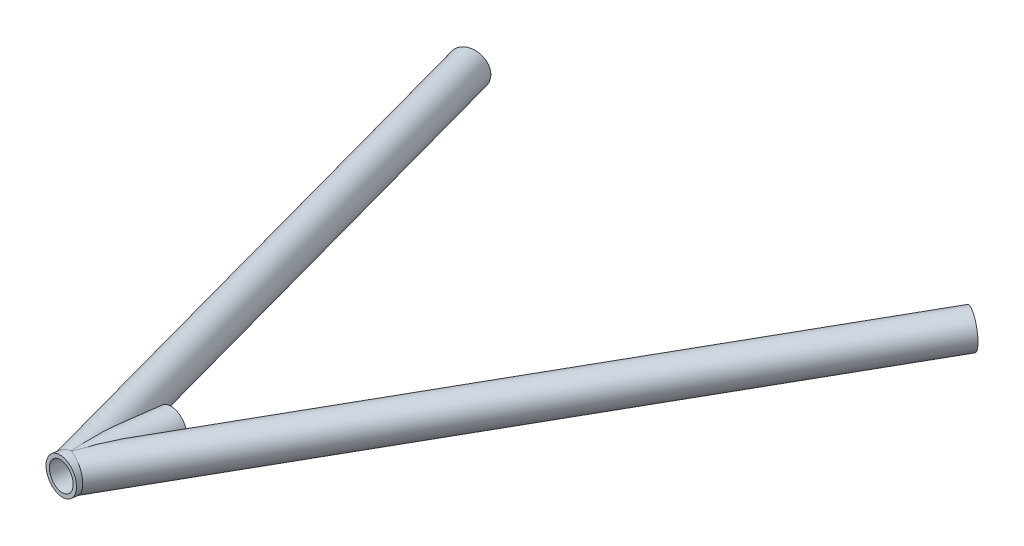
ISO-10303-21;
HEADER;
FILE_DESCRIPTION(('STEP AP214'),'2;1');
FILE_NAME('part.step','',(''),(''),'','','');
FILE_SCHEMA(('AUTOMOTIVE_DESIGN { 1 0 10303 214 1 1 1 1 }'));
ENDSEC;
DATA;
#1=APPLICATION_CONTEXT('core data for automotive mechanical design processes');
#2=APPLICATION_PROTOCOL_DEFINITION('international standard','automotive_design',2000,#1);
#3=PRODUCT_CONTEXT('',#1,'mechanical');
#4=PRODUCT('Part','Part','',(#3));
#5=PRODUCT_RELATED_PRODUCT_CATEGORY('part','',(#4));
#6=PRODUCT_DEFINITION_FORMATION('','',#4);
#7=PRODUCT_DEFINITION_CONTEXT('part definition',#1,'design');
#8=PRODUCT_DEFINITION('design','',#6,#7);
#9=PRODUCT_DEFINITION_SHAPE('','',#8);
#10=(LENGTH_UNIT() NAMED_UNIT(*) SI_UNIT(.MILLI.,.METRE.));
#11=(NAMED_UNIT(*) PLANE_ANGLE_UNIT() SI_UNIT($,.RADIAN.));
#12=(NAMED_UNIT(*) SI_UNIT($,.STERADIAN.) SOLID_ANGLE_UNIT());
#13=UNCERTAINTY_MEASURE_WITH_UNIT(LENGTH_MEASURE(1.E-05),#10,'distance_accuracy_value','');
#14=(GEOMETRIC_REPRESENTATION_CONTEXT(3) GLOBAL_UNCERTAINTY_ASSIGNED_CONTEXT((#13)) GLOBAL_UNIT_ASSIGNED_CONTEXT((#10,
#11,#12)) REPRESENTATION_CONTEXT('',''));
#15=CARTESIAN_POINT('',(0.,0.,0.));
#16=DIRECTION('',(0.,0.,1.));
#17=DIRECTION('',(1.,0.,0.));
#18=AXIS2_PLACEMENT_3D('',#15,#16,#17);
#19=CARTESIAN_POINT('',(3.75423528508109,133.137476358283,665.631869893478));
#20=DIRECTION('',(0.49375074260803,-0.000241320421330066,-0.86960344177014));
#21=DIRECTION('',(-0.869603467091057,0.,-0.493750756984952));
#22=AXIS2_PLACEMENT_3D('',#19,#20,#21);
#23=CYLINDRICAL_SURFACE('',#22,7.4168);
#24=CARTESIAN_POINT('',(182.718724008719,133.050007556528,350.436120461955));
#25=DIRECTION('',(-0.49375074260803,0.000241320421330071,0.86960344177014));
#26=DIRECTION('',(0.869603467091057,0.,0.493750756984952));
#27=AXIS2_PLACEMENT_3D('',#24,#25,#26);
#28=CIRCLE('',#27,7.4168);
#29=CARTESIAN_POINT('',(189.16839900344,133.050007556528,354.098171076361));
#30=VERTEX_POINT('',#29);
#31=EDGE_CURVE('E107',#30,#30,#28,.T.);
#32=ORIENTED_EDGE('',*,*,#31,.F.);
#33=EDGE_LOOP('',(#32));
#34=FACE_BOUND('',#33,.T.);
#35=CARTESIAN_POINT('',(17.8808395852087,133.127419712368,625.730474707942));
#36=CARTESIAN_POINT('',(17.8902756492484,133.033441099937,625.713861412463));
#37=CARTESIAN_POINT('',(17.8975971967898,132.937846745353,625.704613167863));
#38=CARTESIAN_POINT('',(17.9074973202,132.746191824254,625.702121806519));
#39=CARTESIAN_POINT('',(17.9100747188445,132.650131147951,625.708882661359));
#40=CARTESIAN_POINT('',(17.9105278099581,132.460708783187,625.737765855803));
#41=CARTESIAN_POINT('',(17.9084187404123,132.367339344448,625.759838249599));
#42=CARTESIAN_POINT('',(17.9000456186195,132.185005407172,625.817245823827));
#43=CARTESIAN_POINT('',(17.8937780961098,132.09604465441,625.852592070695));
#44=CARTESIAN_POINT('',(17.8732258774253,131.874014353576,625.957339904689));
#45=CARTESIAN_POINT('',(17.8564042754071,131.744940066849,626.034643148636));
#46=CARTESIAN_POINT('',(17.8168989728798,131.500190672569,626.206920704838));
#47=CARTESIAN_POINT('',(17.7941970852065,131.384558777849,626.301949580938));
#48=CARTESIAN_POINT('',(17.7454433154982,131.167814439191,626.501099050278));
#49=CARTESIAN_POINT('',(17.7194893664602,131.066411289716,626.604932974647));
#50=CARTESIAN_POINT('',(17.6649008274699,130.872860871437,626.820320152897));
#51=CARTESIAN_POINT('',(17.6362634944278,130.780723278227,626.931881274854));
#52=CARTESIAN_POINT('',(17.5769907633527,130.604005044662,627.160729450409));
#53=CARTESIAN_POINT('',(17.5463506242003,130.519443548459,627.278029912392));
#54=CARTESIAN_POINT('',(17.4836420610055,130.356912129069,627.516617423823));
#55=CARTESIAN_POINT('',(17.4515743324118,130.278939048851,627.637902524774));
#56=CARTESIAN_POINT('',(17.3615870226684,130.071420209845,627.976753476499));
#57=CARTESIAN_POINT('',(17.3025161882504,129.947639923559,628.19753909579));
#58=CARTESIAN_POINT('',(17.1821457717575,129.713147881691,628.645408526889));
#59=CARTESIAN_POINT('',(17.1208448286195,129.602444288118,628.872496164147));
#60=CARTESIAN_POINT('',(16.9966042333876,129.391329996882,629.331520382625));
#61=CARTESIAN_POINT('',(16.933661547833,129.290940337429,629.563465756906));
#62=CARTESIAN_POINT('',(16.8067072288981,129.098813950447,630.030630787713));
#63=CARTESIAN_POINT('',(16.7426954712505,129.007078237196,630.265850824344));
#64=CARTESIAN_POINT('',(16.6136136505078,128.830475223504,630.739925600838));
#65=CARTESIAN_POINT('',(16.5485399808433,128.745643031836,630.978792372565));
#66=CARTESIAN_POINT('',(16.4178653160346,128.582288520287,631.458534903441));
#67=CARTESIAN_POINT('',(16.3522642955801,128.503766505277,631.699410759038));
#68=CARTESIAN_POINT('',(16.2208000482123,128.352328031729,632.182473578702));
#69=CARTESIAN_POINT('',(16.1549372739287,128.279404407495,632.42465842724));
#70=CARTESIAN_POINT('',(16.0230052917129,128.13841872491,632.910376188822));
#71=CARTESIAN_POINT('',(15.9569360853337,128.070356630076,633.153909091735));
#72=CARTESIAN_POINT('',(15.8104909404638,127.924416472192,633.694608376876));
#73=CARTESIAN_POINT('',(15.730093199586,127.847574278643,633.992048301148));
#74=CARTESIAN_POINT('',(15.569338008422,127.699591553392,634.588357478155));
#75=CARTESIAN_POINT('',(15.4889805596053,127.628451216473,634.887226779348));
#76=CARTESIAN_POINT('',(15.2481834575579,127.422683573267,635.785740200492));
#77=CARTESIAN_POINT('',(15.0880360305141,127.295726228689,636.387227295318));
#78=CARTESIAN_POINT('',(14.769465248831,127.058830082422,637.594693663379));
#79=CARTESIAN_POINT('',(14.6110440060494,126.948910334559,638.200677183085));
#80=CARTESIAN_POINT('',(14.2971964198353,126.744144581536,639.415904373446));
#81=CARTESIAN_POINT('',(14.1417698718495,126.6492975436,640.025147817774));
#82=CARTESIAN_POINT('',(13.8356109366829,126.473605237434,641.244652386721));
#83=CARTESIAN_POINT('',(13.6848648232677,126.392715058237,641.854903616778));
#84=CARTESIAN_POINT('',(13.3889662914121,126.24383688354,643.078362163692));
#85=CARTESIAN_POINT('',(13.2438141318387,126.175849484563,643.691569615878));
#86=CARTESIAN_POINT('',(12.9610549558231,126.052691694737,644.920531743804));
#87=CARTESIAN_POINT('',(12.8234424659017,125.997511909338,645.536284213142));
#88=CARTESIAN_POINT('',(12.5581006723453,125.900424734636,646.770924465766));
#89=CARTESIAN_POINT('',(12.4303704311098,125.858516085034,647.389811945659));
#90=CARTESIAN_POINT('',(12.2140905809011,125.796789292402,648.498369354339));
#91=CARTESIAN_POINT('',(12.1230018790965,125.774164099645,648.987384090745));
#92=CARTESIAN_POINT('',(11.9513327278673,125.739289342594,649.967729441095));
#93=CARTESIAN_POINT('',(11.8707540011282,125.727041477439,650.459060421054));
#94=CARTESIAN_POINT('',(11.7231426612826,125.714960269534,651.444302805225));
#95=CARTESIAN_POINT('',(11.6561185239455,125.715134670582,651.938215627101));
#96=CARTESIAN_POINT('',(11.5690186332072,125.727243491945,652.680415828663));
#97=CARTESIAN_POINT('',(11.5422264903298,125.733253251557,652.92801585884));
#98=CARTESIAN_POINT('',(11.4938103428964,125.749836294096,653.423562321139));
#99=CARTESIAN_POINT('',(11.4721860647823,125.760409335386,653.671508734227));
#100=CARTESIAN_POINT('',(11.4290444115154,125.790990661345,654.245185476086));
#101=CARTESIAN_POINT('',(11.4096764493194,125.812915818618,654.570985612947));
#102=CARTESIAN_POINT('',(11.3832796911853,125.868124181302,655.222242928684));
#103=CARTESIAN_POINT('',(11.3762531519639,125.901409462664,655.547700033962));
#104=CARTESIAN_POINT('',(11.377000985245,125.982274838213,656.196261428939));
#105=CARTESIAN_POINT('',(11.3847469892731,126.029827386476,656.519369034533));
#106=CARTESIAN_POINT('',(11.417643686126,126.143193648727,657.161477881985));
#107=CARTESIAN_POINT('',(11.4427843428433,126.208996819635,657.480481383718));
#108=CARTESIAN_POINT('',(11.5001966314537,126.335940445412,657.997218996666));
#109=CARTESIAN_POINT('',(11.5266465640857,126.390237618012,658.197283045598));
#110=CARTESIAN_POINT('',(11.5880036167678,126.509785914246,658.592763002485));
#111=CARTESIAN_POINT('',(11.6229077494385,126.575033166058,658.78818052561));
#112=CARTESIAN_POINT('',(11.7011836635038,126.717857610525,659.172505134255));
#113=CARTESIAN_POINT('',(11.744546120195,126.795421207927,659.361419122066));
#114=CARTESIAN_POINT('',(11.8393085295068,126.964221209537,659.730982821725));
#115=CARTESIAN_POINT('',(11.8907082595944,127.055457235184,659.911632762208));
#116=CARTESIAN_POINT('',(12.0011160266924,127.253702919322,660.264617088224));
#117=CARTESIAN_POINT('',(12.060205412812,127.360883294599,660.436830687333));
#118=CARTESIAN_POINT('',(12.1837504491556,127.590677320362,660.768604882814));
#119=CARTESIAN_POINT('',(12.2482061663706,127.713291163524,660.928165321181));
#120=CARTESIAN_POINT('',(12.3801788932863,127.973809907857,661.232950282114));
#121=CARTESIAN_POINT('',(12.4476964254278,128.111717424453,661.378172344572));
#122=CARTESIAN_POINT('',(12.5831534786929,128.40205379099,661.653054639843));
#123=CARTESIAN_POINT('',(12.6510929618811,128.554481352685,661.782716250906));
#124=CARTESIAN_POINT('',(12.7751748394273,128.849883606177,662.008465187573));
#125=CARTESIAN_POINT('',(12.8316161640599,128.991098621851,662.106702753583));
#126=CARTESIAN_POINT('',(12.9412726602176,129.282333437735,662.29115531854));
#127=CARTESIAN_POINT('',(12.9944882102257,129.432352200913,662.37737172949));
#128=CARTESIAN_POINT('',(13.0962885268659,129.740174245292,662.537852280775));
#129=CARTESIAN_POINT('',(13.1448725892241,129.897978704885,662.612114604524));
#130=CARTESIAN_POINT('',(13.2361828958061,130.220253786529,662.748845432038));
#131=CARTESIAN_POINT('',(13.2789088548467,130.384724732611,662.811313361686));
#132=CARTESIAN_POINT('',(13.35820642468,130.722275283216,662.925720398267));
#133=CARTESIAN_POINT('',(13.3946504834968,130.895457552974,662.977444880283));
#134=CARTESIAN_POINT('',(13.459546982411,131.246364284483,663.069147074323));
#135=CARTESIAN_POINT('',(13.4879994273411,131.424088743488,663.109124793452));
#136=CARTESIAN_POINT('',(13.5362606365176,131.782906484864,663.177572209979));
#137=CARTESIAN_POINT('',(13.5560687949229,131.964000002432,663.206041100762));
#138=CARTESIAN_POINT('',(13.5865766091222,132.328367947054,663.251663362793));
#139=CARTESIAN_POINT('',(13.5972759822271,132.511642441616,663.268816382851));
#140=CARTESIAN_POINT('',(13.609579972908,132.888326312208,663.292523611119));
#141=CARTESIAN_POINT('',(13.610707053733,133.081787402882,663.298509780162));
#142=CARTESIAN_POINT('',(13.6024898877211,133.468482996136,663.298268587226));
#143=CARTESIAN_POINT('',(13.5931452937816,133.661717490992,663.292040820388));
#144=CARTESIAN_POINT('',(13.5640641940597,134.046665666074,663.267389150746));
#145=CARTESIAN_POINT('',(13.5443253484375,134.238378994006,663.248962501623));
#146=CARTESIAN_POINT('',(13.494743154922,134.618908688156,663.199856626034));
#147=CARTESIAN_POINT('',(13.4648998090722,134.807725054962,663.169177402046));
#148=CARTESIAN_POINT('',(13.3951588719526,135.183560948944,663.094963413212));
#149=CARTESIAN_POINT('',(13.355135790128,135.370525330841,663.051266933493));
#150=CARTESIAN_POINT('',(13.265988567622,135.738747203561,662.950982733271));
#151=CARTESIAN_POINT('',(13.2168642835546,135.92000460442,662.894394809665));
#152=CARTESIAN_POINT('',(13.1105283109679,136.275421665829,662.768103141341));
#153=CARTESIAN_POINT('',(13.0533175246094,136.449582115354,662.698400859424));
#154=CARTESIAN_POINT('',(12.9320810830876,136.789472842009,662.545639333686));
#155=CARTESIAN_POINT('',(12.8680556317214,136.955203371023,662.462580489264));
#156=CARTESIAN_POINT('',(12.7362703017275,137.273247890752,662.284972099191));
#157=CARTESIAN_POINT('',(12.6686292910275,137.425782011655,662.190728728829));
#158=CARTESIAN_POINT('',(12.5300275701335,137.720409182487,661.989246849203));
#159=CARTESIAN_POINT('',(12.4590669396858,137.862502483024,661.882008652012));
#160=CARTESIAN_POINT('',(12.3157894113179,138.135137845336,661.654756498028));
#161=CARTESIAN_POINT('',(12.2434735513222,138.265688341732,661.534752013552));
#162=CARTESIAN_POINT('',(12.0994740863703,138.514552882891,661.282323968567));
#163=CARTESIAN_POINT('',(12.0277904465702,138.632867605917,661.149901097222));
#164=CARTESIAN_POINT('',(11.8910784829007,138.850420302739,660.881241779546));
#165=CARTESIAN_POINT('',(11.8259032093607,138.950359373559,660.745646670171));
#166=CARTESIAN_POINT('',(11.6995013789206,139.138798444394,660.465020974085));
#167=CARTESIAN_POINT('',(11.6382745455565,139.227299245737,660.319991049418));
#168=CARTESIAN_POINT('',(11.5211031195913,139.393055692867,660.021681663506));
#169=CARTESIAN_POINT('',(11.465157144434,139.470314284808,659.868404378056));
#170=CARTESIAN_POINT('',(11.3594967538439,139.614133393912,659.554850490273));
#171=CARTESIAN_POINT('',(11.3097831794485,139.68069246756,659.394572947211));
#172=CARTESIAN_POINT('',(11.2003428375716,139.826288827693,659.00891299505));
#173=CARTESIAN_POINT('',(11.1435600376147,139.90104673391,658.781072331338));
#174=CARTESIAN_POINT('',(11.0432145600548,140.034389459542,658.31788287606));
#175=CARTESIAN_POINT('',(10.9996574289435,140.092967492624,658.08253098008));
#176=CARTESIAN_POINT('',(10.9251936446475,140.1965729234,657.606204759654));
#177=CARTESIAN_POINT('',(10.8943253079307,140.241559171035,657.365215694887));
#178=CARTESIAN_POINT('',(10.8444135795279,140.320069410752,656.880261189008));
#179=CARTESIAN_POINT('',(10.825368832679,140.353594716236,656.636296092264));
#180=CARTESIAN_POINT('',(10.7943170161128,140.418605352813,656.08396978721));
#181=CARTESIAN_POINT('',(10.7853631001404,140.447367455511,655.775123903976));
#182=CARTESIAN_POINT('',(10.7816037713285,140.493244139628,655.156425817096));
#183=CARTESIAN_POINT('',(10.7868051121615,140.510353156329,654.846573203566));
#184=CARTESIAN_POINT('',(10.8090984237159,140.535335815315,654.226406756005));
#185=CARTESIAN_POINT('',(10.8262117690693,140.543192787617,653.916093095057));
#186=CARTESIAN_POINT('',(10.8703899498514,140.551407269437,653.296156199912));
#187=CARTESIAN_POINT('',(10.8974532481907,140.551765936814,652.9865328665));
#188=CARTESIAN_POINT('',(10.9600715280981,140.546286878631,652.366615067848));
#189=CARTESIAN_POINT('',(10.9956693892169,140.540417333916,652.056325317012));
#190=CARTESIAN_POINT('',(11.0739389209607,140.523410153787,651.436788913139));
#191=CARTESIAN_POINT('',(11.1166107992238,140.512272363721,651.127542290991));
#192=CARTESIAN_POINT('',(11.2078878227765,140.485459070195,650.510445765628));
#193=CARTESIAN_POINT('',(11.2564870538899,140.469788068791,650.20259478296));
#194=CARTESIAN_POINT('',(11.3587642767749,140.434427375871,649.587967035424));
#195=CARTESIAN_POINT('',(11.4124424132728,140.414737569818,649.281190301426));
#196=CARTESIAN_POINT('',(11.5308294837275,140.369150786451,648.632032392859));
#197=CARTESIAN_POINT('',(11.5960897205968,140.342792945807,648.289784441595));
#198=CARTESIAN_POINT('',(11.7312282826813,140.285900728456,647.606554564));
#199=CARTESIAN_POINT('',(11.8011066486341,140.255366314904,647.265572648866));
#200=CARTESIAN_POINT('',(12.0166543160951,140.157892927734,646.244283527835));
#201=CARTESIAN_POINT('',(12.1682106788131,140.085093643831,645.565769579014));
#202=CARTESIAN_POINT('',(12.482358331742,139.925173184266,644.215693648317));
#203=CARTESIAN_POINT('',(12.6449072070107,139.83810539815,643.544115311846));
#204=CARTESIAN_POINT('',(12.9787741876692,139.649409283716,642.205268490085));
#205=CARTESIAN_POINT('',(13.1500913762887,139.547782475625,641.537999562408));
#206=CARTESIAN_POINT('',(13.447168155139,139.361855558334,640.407052008016));
#207=CARTESIAN_POINT('',(13.5712003062998,139.281485674074,639.942268584028));
#208=CARTESIAN_POINT('',(13.8220605444593,139.112633432841,639.014935950263));
#209=CARTESIAN_POINT('',(13.9488885941118,139.024151184179,638.552386710742));
#210=CARTESIAN_POINT('',(14.2049911017366,138.838239709357,637.629316211924));
#211=CARTESIAN_POINT('',(14.3342675958156,138.740802751571,637.168797071819));
#212=CARTESIAN_POINT('',(14.5947518205429,138.536009829626,636.250522252096));
#213=CARTESIAN_POINT('',(14.7259594861592,138.428654198839,635.792766480151));
#214=CARTESIAN_POINT('',(14.9482407630773,138.238283606942,635.024582695283));
#215=CARTESIAN_POINT('',(15.038901790926,138.158290052959,634.713285784325));
#216=CARTESIAN_POINT('',(15.2208270799683,137.992373343287,634.092456506316));
#217=CARTESIAN_POINT('',(15.312091327386,137.906450322591,633.782924099267));
#218=CARTESIAN_POINT('',(15.4950163011855,137.727987766201,633.166191940205));
#219=CARTESIAN_POINT('',(15.5866766193867,137.63545398071,632.858990411983));
#220=CARTESIAN_POINT('',(15.7703136328907,137.442712594645,632.247119331007));
#221=CARTESIAN_POINT('',(15.8622903130199,137.34250535734,631.942449659148));
#222=CARTESIAN_POINT('',(16.0801279717203,137.094786160677,631.225114215299));
#223=CARTESIAN_POINT('',(16.2060564567331,136.943394411533,630.813780007262));
#224=CARTESIAN_POINT('',(16.3947543668124,136.700007388144,630.202713044638));
#225=CARTESIAN_POINT('',(16.4576841619716,136.616069503634,629.999812782539));
#226=CARTESIAN_POINT('',(16.5833048404375,136.441890865055,629.596666924319));
#227=CARTESIAN_POINT('',(16.6459957444381,136.351650670644,629.396421094353));
#228=CARTESIAN_POINT('',(16.7712704191784,136.163278185625,628.998323938846));
#229=CARTESIAN_POINT('',(16.8338521606515,136.065109399108,628.800489148872));
#230=CARTESIAN_POINT('',(16.9583188398551,135.859739379099,628.409350113403));
#231=CARTESIAN_POINT('',(17.0202039105157,135.75253990302,628.21604499573));
#232=CARTESIAN_POINT('',(17.1427099777888,135.527246264071,627.836118042152));
#233=CARTESIAN_POINT('',(17.2033337312612,135.409179810083,627.649480805216));
#234=CARTESIAN_POINT('',(17.3227226664643,135.159037317933,627.285317600553));
#235=CARTESIAN_POINT('',(17.3814897718739,135.026976441628,627.107782075199));
#236=CARTESIAN_POINT('',(17.4834282094696,134.775214940438,626.80388732925));
#237=CARTESIAN_POINT('',(17.5272089317448,134.659085193838,626.674802701688));
#238=CARTESIAN_POINT('',(17.611729075468,134.412599192183,626.42941826928));
#239=CARTESIAN_POINT('',(17.6524684652557,134.282242789064,626.313118597521));
#240=CARTESIAN_POINT('',(17.7190876635022,134.039500137359,626.127838763741));
#241=CARTESIAN_POINT('',(17.7461171063937,133.930929340556,626.054335307472));
#242=CARTESIAN_POINT('',(17.7957600448045,133.703439838305,625.923910848911));
#243=CARTESIAN_POINT('',(17.8183899449411,133.58456206068,625.866927840177));
#244=CARTESIAN_POINT('',(17.846329216915,133.407044707398,625.801533704781));
#245=CARTESIAN_POINT('',(17.8542159738716,133.352181475292,625.783840548988));
#246=CARTESIAN_POINT('',(17.8686085663113,133.240884460612,625.75335010018));
#247=CARTESIAN_POINT('',(17.8751134147258,133.184449587777,625.740556301474));
#248=CARTESIAN_POINT('',(17.8808395852087,133.127419712368,625.730474707942));
#249=B_SPLINE_CURVE_WITH_KNOTS('',3,(#35,#36,#37,#38,#39,#40,#41,#42,#43,#44,#45,#46,#47,#48,
#49,#50,#51,#52,#53,#54,#55,#56,#57,#58,#59,#60,#61,#62,#63,#64,#65,#66,#67,#68,#69,#70,#71,#72,
#73,#74,#75,#76,#77,#78,#79,#80,#81,#82,#83,#84,#85,#86,#87,#88,#89,#90,#91,#92,#93,#94,#95,#96,
#97,#98,#99,#100,#101,#102,#103,#104,#105,#106,#107,#108,#109,#110,#111,#112,#113,#114,#115,
#116,#117,#118,#119,#120,#121,#122,#123,#124,#125,#126,#127,#128,#129,#130,#131,#132,#133,#134,
#135,#136,#137,#138,#139,#140,#141,#142,#143,#144,#145,#146,#147,#148,#149,#150,#151,#152,#153,
#154,#155,#156,#157,#158,#159,#160,#161,#162,#163,#164,#165,#166,#167,#168,#169,#170,#171,#172,
#173,#174,#175,#176,#177,#178,#179,#180,#181,#182,#183,#184,#185,#186,#187,#188,#189,#190,#191,
#192,#193,#194,#195,#196,#197,#198,#199,#200,#201,#202,#203,#204,#205,#206,#207,#208,#209,#210,
#211,#212,#213,#214,#215,#216,#217,#218,#219,#220,#221,#222,#223,#224,#225,#226,#227,#228,#229,
#230,#231,#232,#233,#234,#235,#236,#237,#238,#239,#240,#241,#242,#243,#244,#245,#246,#247,#248),
.UNSPECIFIED.,.T.,.F.,(4,2,2,2,2,2,2,2,2,2,2,2,2,2,2,2,2,2,2,2,2,2,2,2,2,2,2,2,2,2,2,2,2,2,2,2,
2,2,2,2,2,2,2,2,2,2,2,2,2,2,2,2,2,2,2,2,2,2,2,2,2,2,2,2,2,2,2,2,2,2,2,2,2,2,2,2,2,2,2,2,2,2,2,2,
2,2,2,2,2,2,2,2,2,2,2,2,2,2,2,2,2,2,2,2,2,2,4),(0.,0.287493667617879,0.575058664973744,
0.861690017430713,1.1485608674325,1.60011178645829,2.05307634187898,2.49471734309414,
2.93681484237129,3.37999970657778,3.82297098701334,4.60209329477502,5.38169936196304,
6.16286533871083,6.94412275782985,7.72913291455804,8.51418097562145,9.29820685005758,
10.0822268404569,11.0348164628127,11.9874386128639,13.8928834994701,15.8004441808667,
17.7078741006426,19.60904685706,21.5103074871329,23.4101690792358,25.3098501961042,
26.8034877348338,28.297369788189,29.7921831064909,30.5394581497208,31.286693627591,
32.267673750563,33.2488332340417,34.2281104435784,35.206823114979,35.8333420212897,
36.4596398627791,37.0852511181471,37.7108450548773,38.3436967682545,38.9765563830672,
39.6095243927435,40.242436296463,40.7849448454643,41.3273896177684,41.8699167442636,
42.4124702726045,42.9649960179228,43.5175214291157,44.0700855582345,44.6226668354236,
45.2026623849415,45.7826771600378,46.3628225575454,46.9429678377234,47.530644308164,
48.1183300380109,48.7059502550826,49.2935529039042,49.8677193817336,50.4418720735734,
51.0156016888715,51.589299483637,52.1304874373761,52.6716374566818,53.2126454048409,
53.7537262814518,54.4918002773762,55.2301833756477,55.9707800803126,56.7112918856729,
57.6415242876744,58.572200594463,59.5045512053623,60.4367578452889,61.3737500462086,
62.3107697547835,63.2468620600141,64.1829810478001,65.23114234886,66.2793128972357,
68.3760718033454,70.4651571037848,72.5540244245345,74.0171023190444,75.4801606823248,
76.9444943568768,78.4087788324419,79.4105866153407,80.4123715980399,81.4132955710035,
82.4141721882959,83.7817678138888,84.4669401760436,85.1520517707539,85.8405195621937,
86.5288536828538,87.2154788832668,87.9013676410298,88.4378942737326,88.9744264908917,
89.3750159373205,89.7740817811838,89.9484200043154,90.1228823380398),.UNSPECIFIED.);
#250=CARTESIAN_POINT('',(17.8808395852087,133.127419712368,625.730474707942));
#251=VERTEX_POINT('',#250);
#252=EDGE_CURVE('E81',#251,#251,#249,.T.);
#253=ORIENTED_EDGE('',*,*,#252,.T.);
#254=EDGE_LOOP('',(#253));
#255=FACE_BOUND('',#254,.T.);
#256=ADVANCED_FACE('F63',(#34,#255),#23,.F.);
#257=CARTESIAN_POINT('',(9.44247056550693,132.205085243907,615.965234954071));
#258=DIRECTION('',(-0.113764705608517,0.018647822287539,0.993332698788145));
#259=DIRECTION('',(0.99350545523548,0.,0.113784491110793));
#260=AXIS2_PLACEMENT_3D('',#257,#258,#259);
#261=CYLINDRICAL_SURFACE('',#260,9.52499999999999);
#262=ORIENTED_EDGE('',*,*,#252,.F.);
#263=EDGE_LOOP('',(#262));
#264=FACE_BOUND('',#263,.T.);
#265=CARTESIAN_POINT('',(3.75423528508108,133.137476358283,665.631869893478));
#266=DIRECTION('',(0.949854925607184,0.0460109181876038,0.309287270522575));
#267=DIRECTION('',(0.310022927269246,-0.0096393718602572,-0.950680212835813));
#268=AXIS2_PLACEMENT_3D('',#265,#266,#267);
#269=ELLIPSE('',#268,47.6194769568336,9.52499999999999);
#270=CARTESIAN_POINT('',(3.36599309912906,142.651945783211,665.40879016072));
#271=VERTEX_POINT('',#270);
#272=CARTESIAN_POINT('',(4.14247747103309,123.623006933356,665.854949626237));
#273=VERTEX_POINT('',#272);
#274=EDGE_CURVE('E72',#271,#273,#269,.F.);
#275=ORIENTED_EDGE('',*,*,#274,.T.);
#276=CARTESIAN_POINT('',(3.75423528508108,133.137476358283,665.631869893478));
#277=DIRECTION('',(0.310022927269246,-0.0096393718602572,-0.950680212835813));
#278=DIRECTION('',(0.949854925607184,0.0460109181876038,0.309287270522575));
#279=AXIS2_PLACEMENT_3D('',#276,#277,#278);
#280=ELLIPSE('',#279,9.72145939962004,9.52499999999999);
#281=EDGE_CURVE('E13',#273,#271,#280,.F.);
#282=ORIENTED_EDGE('',*,*,#281,.T.);
#283=EDGE_LOOP('',(#275,#282));
#284=FACE_BOUND('',#283,.T.);
#285=ADVANCED_FACE('F79',(#264,#284),#261,.F.);
#286=CARTESIAN_POINT('',(3.75423528508109,133.137476358283,665.631869893478));
#287=DIRECTION('',(0.49375074260803,-0.000241320421330066,-0.86960344177014));
#288=DIRECTION('',(-0.869603467091057,0.,-0.493750756984952));
#289=AXIS2_PLACEMENT_3D('',#286,#287,#288);
#290=CYLINDRICAL_SURFACE('',#289,9.52499999999998);
#291=CARTESIAN_POINT('',(182.718724008719,133.050007556528,350.436120461955));
#292=DIRECTION('',(-0.49375074260803,0.000241320421330071,0.86960344177014));
#293=DIRECTION('',(0.869603467091057,0.,0.493750756984952));
#294=AXIS2_PLACEMENT_3D('',#291,#292,#293);
#295=CIRCLE('',#294,9.52499999999998);
#296=CARTESIAN_POINT('',(191.001697032761,133.050007556528,355.139096422237));
#297=VERTEX_POINT('',#296);
#298=EDGE_CURVE('E67',#297,#297,#295,.T.);
#299=ORIENTED_EDGE('',*,*,#298,.T.);
#300=EDGE_LOOP('',(#299));
#301=FACE_BOUND('',#300,.T.);
#302=ORIENTED_EDGE('',*,*,#274,.F.);
#303=ORIENTED_EDGE('',*,*,#281,.F.);
#304=EDGE_LOOP('',(#302,#303));
#305=FACE_BOUND('',#304,.T.);
#306=ADVANCED_FACE('F65',(#301,#305),#290,.T.);
#307=CARTESIAN_POINT('',(182.718724008719,133.050007556528,350.436120461955));
#308=DIRECTION('',(-0.49375074260803,0.000241320421330071,0.86960344177014));
#309=DIRECTION('',(0.869603467091057,0.,0.493750756984952));
#310=AXIS2_PLACEMENT_3D('',#307,#308,#309);
#311=PLANE('',#310);
#312=ORIENTED_EDGE('',*,*,#31,.T.);
#313=EDGE_LOOP('',(#312));
#314=FACE_BOUND('',#313,.T.);
#315=ORIENTED_EDGE('',*,*,#298,.F.);
#316=EDGE_LOOP('',(#315));
#317=FACE_BOUND('',#316,.T.);
#318=ADVANCED_FACE('F84',(#314,#317),#311,.F.);
#319=CLOSED_SHELL('',(#256,#285,#306,#318));
#320=MANIFOLD_SOLID_BREP('B2',#319);
#321=CARTESIAN_POINT('',(-99.9999999999999,120.799926986381,320.));
#322=DIRECTION('',(0.28734441952249,0.0341684939690268,0.957217686103413));
#323=DIRECTION('',(0.95777694496046,0.,-0.287512301827606));
#324=AXIS2_PLACEMENT_3D('',#321,#322,#323);
#325=CYLINDRICAL_SURFACE('',#324,7.4168);
#326=CARTESIAN_POINT('',(-89.9429453167127,121.995824275297,353.50261901362));
#327=DIRECTION('',(0.28734441952249,0.0341684939690268,0.957217686103413));
#328=DIRECTION('',(0.95777694496046,0.,-0.287512301827606));
#329=AXIS2_PLACEMENT_3D('',#326,#327,#328);
#330=CIRCLE('',#329,7.4168);
#331=CARTESIAN_POINT('',(-82.8393052713299,121.995824275297,351.370197773425));
#332=VERTEX_POINT('',#331);
#333=EDGE_CURVE('E189',#332,#332,#330,.T.);
#334=ORIENTED_EDGE('',*,*,#333,.F.);
#335=EDGE_LOOP('',(#334));
#336=FACE_BOUND('',#335,.T.);
#337=CARTESIAN_POINT('',(-1.0306766814161,131.723793369787,623.895644038449));
#338=CARTESIAN_POINT('',(-1.03598895610382,131.830062972237,623.877964575296));
#339=CARTESIAN_POINT('',(-1.04072983950917,131.938149346241,623.870292940105));
#340=CARTESIAN_POINT('',(-1.04884587308507,132.153831138703,623.87589287422));
#341=CARTESIAN_POINT('',(-1.05222006787529,132.261426161913,623.889179062394));
#342=CARTESIAN_POINT('',(-1.05757505184152,132.471615671778,623.934422200887));
#343=CARTESIAN_POINT('',(-1.05956667625504,132.574243040972,623.966230288734));
#344=CARTESIAN_POINT('',(-1.06235759253172,132.773513722009,624.044879340147));
#345=CARTESIAN_POINT('',(-1.06315570631933,132.870151031216,624.091735101455));
#346=CARTESIAN_POINT('',(-1.06398902813661,133.121979227553,624.233574318152));
#347=CARTESIAN_POINT('',(-1.06310462840534,133.271029340199,624.33933861955));
#348=CARTESIAN_POINT('',(-1.05944064753744,133.552328723568,624.57118135454));
#349=CARTESIAN_POINT('',(-1.05665464458505,133.684519257573,624.697327513458));
#350=CARTESIAN_POINT('',(-1.05090921206943,133.894522830007,624.919590660995));
#351=CARTESIAN_POINT('',(-1.04829694048618,133.97610093822,625.012233839923));
#352=CARTESIAN_POINT('',(-1.04261064669264,134.133795394312,625.202065373635));
#353=CARTESIAN_POINT('',(-1.03953649743626,134.2099102309,625.299254973896));
#354=CARTESIAN_POINT('',(-1.02976512516838,134.431443571505,625.596349972568));
#355=CARTESIAN_POINT('',(-1.02252680201151,134.569794198624,625.801497689039));
#356=CARTESIAN_POINT('',(-1.00709918633588,134.83282357498,626.22171452393));
#357=CARTESIAN_POINT('',(-0.998904906545216,134.957423363817,626.436831792237));
#358=CARTESIAN_POINT('',(-0.986166234477147,135.135659593594,626.764015670469));
#359=CARTESIAN_POINT('',(-0.981847604952428,135.193602537762,626.873775601128));
#360=CARTESIAN_POINT('',(-0.973087954769081,135.306910252146,627.094612702099));
#361=CARTESIAN_POINT('',(-0.968646934919654,135.3622750394,627.2056898637));
#362=CARTESIAN_POINT('',(-0.955818466749628,135.517158274448,627.524682194557));
#363=CARTESIAN_POINT('',(-0.94731193483376,135.613835759672,627.733973771549));
#364=CARTESIAN_POINT('',(-0.930087069448808,135.800461658632,628.155540577819));
#365=CARTESIAN_POINT('',(-0.921368705408976,135.890409093383,628.36781623586));
#366=CARTESIAN_POINT('',(-0.903810152623428,136.064559634866,628.794819377207));
#367=CARTESIAN_POINT('',(-0.894969906954623,136.148759940155,629.009547997513));
#368=CARTESIAN_POINT('',(-0.877246030259563,136.312109423992,629.440920891137));
#369=CARTESIAN_POINT('',(-0.868362396845575,136.391258321098,629.657565270427));
#370=CARTESIAN_POINT('',(-0.841702391051015,136.622381363721,630.310826414527));
#371=CARTESIAN_POINT('',(-0.823956406207949,136.767651619687,630.749821832033));
#372=CARTESIAN_POINT('',(-0.788963107447627,137.043762919287,631.632164933916));
#373=CARTESIAN_POINT('',(-0.771715665164301,137.174607702092,632.075511457856));
#374=CARTESIAN_POINT('',(-0.738043366969927,137.424338782965,632.965960123924));
#375=CARTESIAN_POINT('',(-0.721619179489953,137.543215440186,633.41306498438));
#376=CARTESIAN_POINT('',(-0.689932981885975,137.770564220148,634.309968853863));
#377=CARTESIAN_POINT('',(-0.674671042566547,137.879035709106,634.75976802523));
#378=CARTESIAN_POINT('',(-0.645660069155352,138.086643107615,635.660961827187));
#379=CARTESIAN_POINT('',(-0.631909159246254,138.185790569596,636.112353744888));
#380=CARTESIAN_POINT('',(-0.606254974722383,138.375784255842,637.016918591381));
#381=CARTESIAN_POINT('',(-0.594351657268852,138.466630672557,637.470091478628));
#382=CARTESIAN_POINT('',(-0.573973662768926,138.631144062479,638.328304636324));
#383=CARTESIAN_POINT('',(-0.565266373812514,138.705603243571,638.733188002534));
#384=CARTESIAN_POINT('',(-0.549963728357252,138.848763187321,639.544016013025));
#385=CARTESIAN_POINT('',(-0.543368396631254,138.917463882425,639.949960669699));
#386=CARTESIAN_POINT('',(-0.532669234194387,139.049339808787,640.762930426574));
#387=CARTESIAN_POINT('',(-0.528566308805915,139.112513025164,641.169955865497));
#388=CARTESIAN_POINT('',(-0.523308577772878,139.233410160733,641.984833999035));
#389=CARTESIAN_POINT('',(-0.522153763844045,139.291134095238,642.392686691321));
#390=CARTESIAN_POINT('',(-0.523335722366344,139.401016208232,643.208294219255));
#391=CARTESIAN_POINT('',(-0.525665404681137,139.453185457995,643.616047569713));
#392=CARTESIAN_POINT('',(-0.534463017906564,139.551964086985,644.43217641171));
#393=CARTESIAN_POINT('',(-0.540930855481408,139.598573591584,644.84055188901));
#394=CARTESIAN_POINT('',(-0.558815590430817,139.685950276476,645.657725249953));
#395=CARTESIAN_POINT('',(-0.570231293333509,139.726718863675,646.066523007905));
#396=CARTESIAN_POINT('',(-0.599025804826678,139.801962054436,646.884476947877));
#397=CARTESIAN_POINT('',(-0.616404366004767,139.836436919048,647.293633114323));
#398=CARTESIAN_POINT('',(-0.660330001328172,139.901233484981,648.149771503553));
#399=CARTESIAN_POINT('',(-0.687573435940961,139.930881388944,648.596770943032));
#400=CARTESIAN_POINT('',(-0.752831139661977,139.980407310463,649.490607641651));
#401=CARTESIAN_POINT('',(-0.790846844642369,140.000284024618,649.937444871213));
#402=CARTESIAN_POINT('',(-0.880486782160695,140.028102715333,650.830604676185));
#403=CARTESIAN_POINT('',(-0.932122761389658,140.036034350151,651.276926471726));
#404=CARTESIAN_POINT('',(-1.02252908178519,140.036385401407,651.944612693679));
#405=CARTESIAN_POINT('',(-1.0548199533721,140.034578662222,652.166856548267));
#406=CARTESIAN_POINT('',(-1.12428546364334,140.026509644197,652.61049261359));
#407=CARTESIAN_POINT('',(-1.16145981990028,140.020247622928,652.831884872814));
#408=CARTESIAN_POINT('',(-1.2545709015963,139.999615274746,653.346865600083));
#409=CARTESIAN_POINT('',(-1.31263762531147,139.983242148889,653.640000247653));
#410=CARTESIAN_POINT('',(-1.44013648591603,139.939126401517,654.223027375331));
#411=CARTESIAN_POINT('',(-1.50957027819852,139.911382123128,654.512919376631));
#412=CARTESIAN_POINT('',(-1.66128402547727,139.84172653742,655.086986762367));
#413=CARTESIAN_POINT('',(-1.74353557007292,139.799846328428,655.371173257));
#414=CARTESIAN_POINT('',(-1.92240420675561,139.698309802539,655.931756305328));
#415=CARTESIAN_POINT('',(-2.01901374591654,139.638662815266,656.208156864371));
#416=CARTESIAN_POINT('',(-2.19327537808344,139.520391969075,656.66126739952));
#417=CARTESIAN_POINT('',(-2.2668474014411,139.467767525724,656.84111470155));
#418=CARTESIAN_POINT('',(-2.42058431136483,139.35115759139,657.194161747864));
#419=CARTESIAN_POINT('',(-2.50074694223716,139.28717597888,657.367363737042));
#420=CARTESIAN_POINT('',(-2.66698342159409,139.146627559298,657.705448839253));
#421=CARTESIAN_POINT('',(-2.75305170456787,139.070072509165,657.870339537382));
#422=CARTESIAN_POINT('',(-2.93000843045551,138.903293049835,658.190369644736));
#423=CARTESIAN_POINT('',(-3.02089678093325,138.813068902714,658.345509240836));
#424=CARTESIAN_POINT('',(-3.20662578893466,138.617429490963,658.645902289107));
#425=CARTESIAN_POINT('',(-3.30149451940569,138.511885608672,658.791054941085));
#426=CARTESIAN_POINT('',(-3.49221174028417,138.286071102502,659.068738731995));
#427=CARTESIAN_POINT('',(-3.58806025549066,138.165800105018,659.201269550579));
#428=CARTESIAN_POINT('',(-3.77830694696853,137.910874483668,659.453012620181));
#429=CARTESIAN_POINT('',(-3.87270443490035,137.776213260414,659.572218708734));
#430=CARTESIAN_POINT('',(-4.05749104433763,137.493425000322,659.796963644491));
#431=CARTESIAN_POINT('',(-4.14788040656095,137.345298773792,659.902503313199));
#432=CARTESIAN_POINT('',(-4.31216583174753,137.054741885187,660.088566325051));
#433=CARTESIAN_POINT('',(-4.38675815815442,136.91364806888,660.170571498183));
#434=CARTESIAN_POINT('',(-4.52954326315347,136.622896027954,660.324285205289));
#435=CARTESIAN_POINT('',(-4.59773665934707,136.47323863211,660.395994733316));
#436=CARTESIAN_POINT('',(-4.72649826246779,136.166406389263,660.529493977542));
#437=CARTESIAN_POINT('',(-4.78706608364938,136.009231162521,660.591283191958));
#438=CARTESIAN_POINT('',(-4.89955248842458,135.688460513062,660.705344702459));
#439=CARTESIAN_POINT('',(-4.95147062430682,135.524864758558,660.757616505932));
#440=CARTESIAN_POINT('',(-5.0475347768628,135.186355950204,660.854755050853));
#441=CARTESIAN_POINT('',(-5.09133219333104,135.011247557359,660.899285992818));
#442=CARTESIAN_POINT('',(-5.16804136329313,134.656564690267,660.978928496744));
#443=CARTESIAN_POINT('',(-5.20095297399777,134.47699015747,661.014039935148));
#444=CARTESIAN_POINT('',(-5.25537717668151,134.114569808467,661.075153454968));
#445=CARTESIAN_POINT('',(-5.27688826765889,133.931723564779,661.101154336728));
#446=CARTESIAN_POINT('',(-5.30816388780258,133.563987623375,661.144256545547));
#447=CARTESIAN_POINT('',(-5.31792809235703,133.379097869331,661.161357626662));
#448=CARTESIAN_POINT('',(-5.32570535247071,132.999915521292,661.187365194998));
#449=CARTESIAN_POINT('',(-5.32315554089905,132.805582620635,661.195857268234));
#450=CARTESIAN_POINT('',(-5.30498125669431,132.417342205469,661.203249465411));
#451=CARTESIAN_POINT('',(-5.28935636075026,132.223434704936,661.202149278788));
#452=CARTESIAN_POINT('',(-5.24519105782126,131.837353300717,661.190251882277));
#453=CARTESIAN_POINT('',(-5.21664796032934,131.645179766676,661.179452651883));
#454=CARTESIAN_POINT('',(-5.14699852088058,131.263947407094,661.147931026582));
#455=CARTESIAN_POINT('',(-5.10589221510756,131.074888572584,661.127208660255));
#456=CARTESIAN_POINT('',(-5.01124055725656,130.699520592722,661.075267338839));
#457=CARTESIAN_POINT('',(-4.95758582375108,130.513251908722,661.043954935578));
#458=CARTESIAN_POINT('',(-4.8388352944373,130.146599127699,660.970424524209));
#459=CARTESIAN_POINT('',(-4.77373934529109,129.96621510958,660.928206369935));
#460=CARTESIAN_POINT('',(-4.63315716459788,129.612713753446,660.832330370808));
#461=CARTESIAN_POINT('',(-4.55767280808205,129.439595111424,660.778674589404));
#462=CARTESIAN_POINT('',(-4.39761504625278,129.10191516164,660.659329037507));
#463=CARTESIAN_POINT('',(-4.31304196216281,128.937353551751,660.593639692258));
#464=CARTESIAN_POINT('',(-4.13884728869822,128.622461892179,660.451640851695));
#465=CARTESIAN_POINT('',(-4.04942957182437,128.471864349976,660.37567467237));
#466=CARTESIAN_POINT('',(-3.86525005108301,128.181028077293,660.211385259393));
#467=CARTESIAN_POINT('',(-3.77048841285719,128.040789026049,660.123062408626));
#468=CARTESIAN_POINT('',(-3.57765911964315,127.771691943157,659.933890571977));
#469=CARTESIAN_POINT('',(-3.47959413371849,127.642825013939,659.833051530155));
#470=CARTESIAN_POINT('',(-3.28219702268531,127.397035176557,659.618844673028));
#471=CARTESIAN_POINT('',(-3.18286496230891,127.280111660958,659.505477495508));
#472=CARTESIAN_POINT('',(-2.99078273103408,127.064985902275,659.273555240053));
#473=CARTESIAN_POINT('',(-2.89798436432277,126.966091785011,659.155680199382));
#474=CARTESIAN_POINT('',(-2.71478715635389,126.779215048255,658.909844907201));
#475=CARTESIAN_POINT('',(-2.62438845823127,126.691233078504,658.781884055894));
#476=CARTESIAN_POINT('',(-2.4474106306464,126.525889217038,658.516819482189));
#477=CARTESIAN_POINT('',(-2.36083132914819,126.448526846655,658.379716172292));
#478=CARTESIAN_POINT('',(-2.19255338035504,126.303835891383,658.097466031694));
#479=CARTESIAN_POINT('',(-2.1108554114499,126.236508699213,657.952318088359));
#480=CARTESIAN_POINT('',(-1.91903795908766,126.084074230981,657.591055505699));
#481=CARTESIAN_POINT('',(-1.81185193556309,126.00381705711,657.371325862196));
#482=CARTESIAN_POINT('',(-1.60985790031231,125.859623793161,656.92109466278));
#483=CARTESIAN_POINT('',(-1.51505601347293,125.795695764253,656.6905878527));
#484=CARTESIAN_POINT('',(-1.33741943854164,125.681348225297,656.221117646545));
#485=CARTESIAN_POINT('',(-1.25461570050639,125.630963374593,655.982134291976));
#486=CARTESIAN_POINT('',(-1.10042818801804,125.541492036485,655.498558139189));
#487=CARTESIAN_POINT('',(-1.02904247856585,125.502403633778,655.253966299482));
#488=CARTESIAN_POINT('',(-0.873788085650369,125.421610469149,654.676163697042));
#489=CARTESIAN_POINT('',(-0.794038628455963,125.383608618378,654.341337899967));
#490=CARTESIAN_POINT('',(-0.650118720714214,125.320351637771,653.667097694018));
#491=CARTESIAN_POINT('',(-0.585956615681653,125.295103328447,653.327680929336));
#492=CARTESIAN_POINT('',(-0.47050472637174,125.25457290517,652.645411673758));
#493=CARTESIAN_POINT('',(-0.419241356833427,125.239311141607,652.302553603982));
#494=CARTESIAN_POINT('',(-0.327533155094845,125.216854625957,651.615230588129));
#495=CARTESIAN_POINT('',(-0.28708639257906,125.209658433767,651.270765939937));
#496=CARTESIAN_POINT('',(-0.214828605456492,125.201888225259,650.577551489687));
#497=CARTESIAN_POINT('',(-0.183103781443576,125.201378136093,650.228792190317));
#498=CARTESIAN_POINT('',(-0.127288533058981,125.206123041942,649.530706086347));
#499=CARTESIAN_POINT('',(-0.103198356567815,125.211378224118,649.181379263691));
#500=CARTESIAN_POINT('',(-0.0614634670163922,125.226921783637,648.482953392258));
#501=CARTESIAN_POINT('',(-0.0438097727325594,125.237203100415,648.133854709841));
#502=CARTESIAN_POINT('',(-0.0139220456785875,125.262291817341,647.435597044917));
#503=CARTESIAN_POINT('',(-0.00168797777625025,125.277099188148,647.086438062816));
#504=CARTESIAN_POINT('',(0.0194058896796493,125.313018339752,646.344234721012));
#505=CARTESIAN_POINT('',(0.0276468688215875,125.334689168923,645.951200191691));
#506=CARTESIAN_POINT('',(0.0391824240005998,125.383005677036,645.165357750076));
#507=CARTESIAN_POINT('',(0.0424768475961285,125.409651509268,644.772549845138));
#508=CARTESIAN_POINT('',(0.0448511942674343,125.467744543691,643.987222001701));
#509=CARTESIAN_POINT('',(0.0439305164895254,125.499192429786,643.594702112234));
#510=CARTESIAN_POINT('',(0.0384616591790529,125.566826845933,642.81009349163));
#511=CARTESIAN_POINT('',(0.03391341571317,125.603013459491,642.418004768214));
#512=CARTESIAN_POINT('',(0.0155447946928136,125.718892782312,641.240589090844));
#513=CARTESIAN_POINT('',(-0.00300022209384826,125.805763292659,640.456029043894));
#514=CARTESIAN_POINT('',(-0.0497246311195677,125.999809357115,638.889844177398));
#515=CARTESIAN_POINT('',(-0.0779022855948665,126.106981247225,638.108218854113));
#516=CARTESIAN_POINT('',(-0.125695495862299,126.284224679428,636.94398632928));
#517=CARTESIAN_POINT('',(-0.142412715022837,126.345570966397,636.559919846295));
#518=CARTESIAN_POINT('',(-0.177533250031082,126.474378883285,635.79289267373));
#519=CARTESIAN_POINT('',(-0.195936535426566,126.541840402756,635.409931964308));
#520=CARTESIAN_POINT('',(-0.234282541581078,126.683537000908,634.645122328095));
#521=CARTESIAN_POINT('',(-0.254226099151412,126.757775765629,634.263274124282));
#522=CARTESIAN_POINT('',(-0.295513271780654,126.913803131349,633.50120190196));
#523=CARTESIAN_POINT('',(-0.316856853747245,126.995591553916,633.120977845287));
#524=CARTESIAN_POINT('',(-0.360758951085729,127.167478133462,632.363858055645));
#525=CARTESIAN_POINT('',(-0.383313020644748,127.257546646737,631.986955365448));
#526=CARTESIAN_POINT('',(-0.429611569210781,127.447617169468,631.235740727118));
#527=CARTESIAN_POINT('',(-0.453355981065567,127.547618618877,630.861428634192));
#528=CARTESIAN_POINT('',(-0.501938318552917,127.759368608359,630.116559212655));
#529=CARTESIAN_POINT('',(-0.52677525262632,127.871106619307,629.745998840091));
#530=CARTESIAN_POINT('',(-0.577493049736712,128.109054615282,629.009657513014));
#531=CARTESIAN_POINT('',(-0.603373603581148,128.235260334096,628.643875184819));
#532=CARTESIAN_POINT('',(-0.635475831155546,128.400170253136,628.202849730574));
#533=CARTESIAN_POINT('',(-0.64123209958106,128.430059111265,628.124252856039));
#534=CARTESIAN_POINT('',(-0.65279045204517,128.49077594165,627.967424179713));
#535=CARTESIAN_POINT('',(-0.658592536885737,128.521603930373,627.889192384351));
#536=CARTESIAN_POINT('',(-0.676068210122278,128.615592197133,627.655071738551));
#537=CARTESIAN_POINT('',(-0.687809331906658,128.680247131831,627.499783545675));
#538=CARTESIAN_POINT('',(-0.711548307043195,128.814583984066,627.190074920141));
#539=CARTESIAN_POINT('',(-0.723547399434397,128.884298708297,627.035668758328));
#540=CARTESIAN_POINT('',(-0.747705694425955,129.029051994185,626.729417234367));
#541=CARTESIAN_POINT('',(-0.759864861677114,129.104089395983,626.57757132319));
#542=CARTESIAN_POINT('',(-0.787270431584585,129.279213873924,626.240999795707));
#543=CARTESIAN_POINT('',(-0.80255634356423,129.380986488014,626.05714478374));
#544=CARTESIAN_POINT('',(-0.833321181385031,129.596697452397,625.696242104104));
#545=CARTESIAN_POINT('',(-0.848800362253521,129.710653814233,625.519205056118));
#546=CARTESIAN_POINT('',(-0.879662586035683,129.952791533654,625.17750356862));
#547=CARTESIAN_POINT('',(-0.895045159487666,130.08082865294,625.012738218809));
#548=CARTESIAN_POINT('',(-0.925572936537854,130.356238430974,624.700509131895));
#549=CARTESIAN_POINT('',(-0.940718819005031,130.503535936254,624.552982162587));
#550=CARTESIAN_POINT('',(-0.964502869881311,130.761309066136,624.338468238765));
#551=CARTESIAN_POINT('',(-0.973398499267803,130.864083232618,624.262359886625));
#552=CARTESIAN_POINT('',(-0.990580595466239,131.079693389178,624.126118404248));
#553=CARTESIAN_POINT('',(-0.998868900784411,131.192496511508,624.065935485584));
#554=CARTESIAN_POINT('',(-1.0110364072792,131.376293992371,623.988831532143));
#555=CARTESIAN_POINT('',(-1.01526664690593,131.444158812023,623.964475047303));
#556=CARTESIAN_POINT('',(-1.02330898077086,131.582341297749,623.923796015301));
#557=CARTESIAN_POINT('',(-1.02712083646625,131.652660333299,623.907478033011));
#558=CARTESIAN_POINT('',(-1.0306766814161,131.723793369787,623.895644038449));
#559=B_SPLINE_CURVE_WITH_KNOTS('',3,(#337,#338,#339,#340,#341,#342,#343,#344,#345,#346,#347,
#348,#349,#350,#351,#352,#353,#354,#355,#356,#357,#358,#359,#360,#361,#362,#363,#364,#365,#366,
#367,#368,#369,#370,#371,#372,#373,#374,#375,#376,#377,#378,#379,#380,#381,#382,#383,#384,#385,
#386,#387,#388,#389,#390,#391,#392,#393,#394,#395,#396,#397,#398,#399,#400,#401,#402,#403,#404,
#405,#406,#407,#408,#409,#410,#411,#412,#413,#414,#415,#416,#417,#418,#419,#420,#421,#422,#423,
#424,#425,#426,#427,#428,#429,#430,#431,#432,#433,#434,#435,#436,#437,#438,#439,#440,#441,#442,
#443,#444,#445,#446,#447,#448,#449,#450,#451,#452,#453,#454,#455,#456,#457,#458,#459,#460,#461,
#462,#463,#464,#465,#466,#467,#468,#469,#470,#471,#472,#473,#474,#475,#476,#477,#478,#479,#480,
#481,#482,#483,#484,#485,#486,#487,#488,#489,#490,#491,#492,#493,#494,#495,#496,#497,#498,#499,
#500,#501,#502,#503,#504,#505,#506,#507,#508,#509,#510,#511,#512,#513,#514,#515,#516,#517,#518,
#519,#520,#521,#522,#523,#524,#525,#526,#527,#528,#529,#530,#531,#532,#533,#534,#535,#536,#537,
#538,#539,#540,#541,#542,#543,#544,#545,#546,#547,#548,#549,#550,#551,#552,#553,#554,#555,#556,
#557,#558),.UNSPECIFIED.,.T.,.F.,(4,2,2,2,2,2,2,2,2,2,2,2,2,2,2,2,2,2,2,2,2,2,2,2,2,2,2,2,2,2,2,
2,2,2,2,2,2,2,2,2,2,2,2,2,2,2,2,2,2,2,2,2,2,2,2,2,2,2,2,2,2,2,2,2,2,2,2,2,2,2,2,2,2,2,2,2,2,2,2,
2,2,2,2,2,2,2,2,2,2,2,2,2,2,2,2,2,2,2,2,2,2,2,2,2,2,2,2,2,2,2,4),(0.,0.323255734929231,
0.646737052599498,0.967653714612628,1.28888693442391,1.8340422460376,2.38104774485595,
2.751237369497,3.12152900717099,3.863255327574,4.60904063229616,4.98158294788399,
5.35412280094921,6.046061682836,6.73810102269545,7.43047532339,8.12288816640595,
9.51078159640421,10.8983144257494,12.2869561774487,13.6756824581407,15.0626647956411,
16.4496149694036,17.6848633474275,18.9201262141465,20.1558375003214,21.3915453141123,
22.6247421692464,23.8579112106955,25.0907827165563,26.3236030739929,27.6698324604075,
29.0162413747446,30.3638153065084,31.0374877997896,31.7111213495923,32.6085831824118,
33.5061758295965,34.4018065513453,35.2969677893842,35.9004504148173,36.5037273460311,
37.106443354551,37.7091478087525,38.3172413334142,38.9253502876386,39.5337393285356,
40.1420917815085,40.6797832294635,41.2174227279048,41.755089412332,42.2927839179735,
42.8499062967704,43.4070359830577,43.9642390032833,44.5214574208279,45.1043807038799,
45.6873228600315,46.2703864829522,46.8534484265823,47.4417957944,48.0301510479918,
48.6184002467194,49.2066286617518,49.7786153527752,50.3505843240715,50.9221017428415,
51.4935900800261,52.0320015822757,52.5704451277536,53.1088643954655,53.647358317502,
54.4180307379285,55.1890828822797,55.9620898909422,56.7349657599543,57.7729894965814,
58.8115677753988,59.8522559119856,60.8927582048026,61.9432017680857,62.9936794335089,
64.0426856410205,65.0916850483525,66.2727665047781,67.45388435869,68.6351705836676,
69.8164776284525,72.1848543819333,74.5528040966956,75.7206433123358,76.8884614396628,
78.056918553048,79.2253480576075,80.3897462653885,81.5540788583158,82.7173756832581,
83.8803303553724,84.1331807176409,84.3860355156605,84.8918282414775,85.4012582459411,
85.9105775800422,86.5423294409205,87.1750284996508,87.8017626348011,88.4261204403539,
88.8097364639071,89.1921386090549,89.4083916675976,89.6247673898873),.UNSPECIFIED.);
#560=CARTESIAN_POINT('',(-1.0306766814161,131.723793369787,623.895644038449));
#561=VERTEX_POINT('',#560);
#562=EDGE_CURVE('E175',#561,#561,#559,.T.);
#563=ORIENTED_EDGE('',*,*,#562,.T.);
#564=EDGE_LOOP('',(#563));
#565=FACE_BOUND('',#564,.T.);
#566=ADVANCED_FACE('F157',(#336,#565),#325,.F.);
#567=CARTESIAN_POINT('',(-99.9999999999999,120.799926986381,320.));
#568=DIRECTION('',(0.28734441952249,0.0341684939690268,0.957217686103413));
#569=DIRECTION('',(0.95777694496046,0.,-0.287512301827606));
#570=AXIS2_PLACEMENT_3D('',#567,#568,#569);
#571=CYLINDRICAL_SURFACE('',#570,9.52499999999998);
#572=CARTESIAN_POINT('',(-89.9429453167127,121.995824275297,353.50261901362));
#573=DIRECTION('',(0.28734441952249,0.0341684939690268,0.957217686103413));
#574=DIRECTION('',(0.95777694496046,0.,-0.287512301827606));
#575=AXIS2_PLACEMENT_3D('',#572,#573,#574);
#576=CIRCLE('',#575,9.52499999999998);
#577=CARTESIAN_POINT('',(-80.8201199159643,121.995824275297,350.764064338712));
#578=VERTEX_POINT('',#577);
#579=EDGE_CURVE('E161',#578,#578,#576,.T.);
#580=ORIENTED_EDGE('',*,*,#579,.T.);
#581=EDGE_LOOP('',(#580));
#582=FACE_BOUND('',#581,.T.);
#583=CARTESIAN_POINT('',(3.75423528508107,133.137476358283,665.631869893478));
#584=DIRECTION('',(0.0886076101519195,0.0269612586344143,0.995701653084906));
#585=DIRECTION('',(0.995232277689981,0.0385099028195892,-0.0896085979626844));
#586=AXIS2_PLACEMENT_3D('',#583,#584,#585);
#587=ELLIPSE('',#586,9.72449450072625,9.52499999999999);
#588=CARTESIAN_POINT('',(3.36599309912913,142.651945783211,665.40879016072));
#589=VERTEX_POINT('',#588);
#590=CARTESIAN_POINT('',(4.14247747103301,123.623006933356,665.854949626237));
#591=VERTEX_POINT('',#590);
#592=EDGE_CURVE('E166',#589,#591,#587,.T.);
#593=ORIENTED_EDGE('',*,*,#592,.F.);
#594=CARTESIAN_POINT('',(3.75423528508107,133.137476358283,665.631869893478));
#595=DIRECTION('',(0.995232277689981,0.0385099028195892,-0.0896085979626844));
#596=DIRECTION('',(0.0886076101519195,0.0269612586344143,0.995701653084906));
#597=AXIS2_PLACEMENT_3D('',#594,#595,#596);
#598=ELLIPSE('',#597,47.2668750275922,9.52499999999999);
#599=EDGE_CURVE('E61',#591,#589,#598,.T.);
#600=ORIENTED_EDGE('',*,*,#599,.F.);
#601=EDGE_LOOP('',(#593,#600));
#602=FACE_BOUND('',#601,.T.);
#603=ADVANCED_FACE('F159',(#582,#602),#571,.T.);
#604=CARTESIAN_POINT('',(9.44247056550693,132.205085243907,615.965234954071));
#605=DIRECTION('',(-0.113764705608517,0.018647822287539,0.993332698788145));
#606=DIRECTION('',(0.99350545523548,0.,0.113784491110793));
#607=AXIS2_PLACEMENT_3D('',#604,#605,#606);
#608=CYLINDRICAL_SURFACE('',#607,9.52499999999999);
#609=ORIENTED_EDGE('',*,*,#562,.F.);
#610=EDGE_LOOP('',(#609));
#611=FACE_BOUND('',#610,.T.);
#612=ORIENTED_EDGE('',*,*,#592,.T.);
#613=ORIENTED_EDGE('',*,*,#599,.T.);
#614=EDGE_LOOP('',(#612,#613));
#615=FACE_BOUND('',#614,.T.);
#616=ADVANCED_FACE('F173',(#611,#615),#608,.F.);
#617=CARTESIAN_POINT('',(-89.9429453167127,121.995824275297,353.50261901362));
#618=DIRECTION('',(0.28734441952249,0.0341684939690268,0.957217686103413));
#619=DIRECTION('',(0.95777694496046,0.,-0.287512301827606));
#620=AXIS2_PLACEMENT_3D('',#617,#618,#619);
#621=PLANE('',#620);
#622=ORIENTED_EDGE('',*,*,#333,.T.);
#623=EDGE_LOOP('',(#622));
#624=FACE_BOUND('',#623,.T.);
#625=ORIENTED_EDGE('',*,*,#579,.F.);
#626=EDGE_LOOP('',(#625));
#627=FACE_BOUND('',#626,.T.);
#628=ADVANCED_FACE('F182',(#624,#627),#621,.F.);
#629=CLOSED_SHELL('',(#566,#603,#616,#628));
#630=MANIFOLD_SOLID_BREP('B7',#629);
#631=CARTESIAN_POINT('',(9.44247056550693,132.205085243907,615.965234954071));
#632=DIRECTION('',(-0.113764705608517,0.018647822287539,0.993332698788145));
#633=DIRECTION('',(0.99350545523548,0.,0.113784491110793));
#634=AXIS2_PLACEMENT_3D('',#631,#632,#633);
#635=CYLINDRICAL_SURFACE('',#634,7.4168);
#636=CARTESIAN_POINT('',(9.44247056550693,132.205085243907,615.965234954071));
#637=DIRECTION('',(0.113764705608517,-0.018647822287539,-0.993332698788145));
#638=DIRECTION('',(-0.99350545523548,0.,-0.113784491110793));
#639=AXIS2_PLACEMENT_3D('',#636,#637,#638);
#640=CIRCLE('',#639,7.4168);
#641=CARTESIAN_POINT('',(2.07383930511642,132.205085243907,615.121318140401));
#642=VERTEX_POINT('',#641);
#643=EDGE_CURVE('E251',#642,#642,#640,.T.);
#644=ORIENTED_EDGE('',*,*,#643,.T.);
#645=EDGE_LOOP('',(#644));
#646=FACE_BOUND('',#645,.T.);
#647=CARTESIAN_POINT('',(3.1854117570385,133.230715469721,670.598533387419));
#648=DIRECTION('',(0.113764705608517,-0.018647822287539,-0.993332698788145));
#649=DIRECTION('',(-0.99350545523548,0.,-0.113784491110793));
#650=AXIS2_PLACEMENT_3D('',#647,#648,#649);
#651=CIRCLE('',#650,7.4168);
#652=CARTESIAN_POINT('',(-4.18321950335201,133.230715469721,669.754616573749));
#653=VERTEX_POINT('',#652);
#654=EDGE_CURVE('E257',#653,#653,#651,.T.);
#655=ORIENTED_EDGE('',*,*,#654,.F.);
#656=EDGE_LOOP('',(#655));
#657=FACE_BOUND('',#656,.T.);
#658=ADVANCED_FACE('F244',(#646,#657),#635,.F.);
#659=CARTESIAN_POINT('',(9.44247056550693,132.205085243907,615.965234954071));
#660=DIRECTION('',(-0.113764705608517,0.018647822287539,0.993332698788145));
#661=DIRECTION('',(0.99350545523548,0.,0.113784491110793));
#662=AXIS2_PLACEMENT_3D('',#659,#660,#661);
#663=CYLINDRICAL_SURFACE('',#662,9.52499999999999);
#664=CARTESIAN_POINT('',(9.44247056550693,132.205085243907,615.965234954071));
#665=DIRECTION('',(0.113764705608517,-0.018647822287539,-0.993332698788145));
#666=DIRECTION('',(-0.99350545523548,0.,-0.113784491110793));
#667=AXIS2_PLACEMENT_3D('',#664,#665,#666);
#668=CIRCLE('',#667,9.52499999999999);
#669=CARTESIAN_POINT('',(-0.0206688956110122,132.205085243907,614.881437676241));
#670=VERTEX_POINT('',#669);
#671=EDGE_CURVE('E156',#670,#670,#668,.T.);
#672=ORIENTED_EDGE('',*,*,#671,.F.);
#673=EDGE_LOOP('',(#672));
#674=FACE_BOUND('',#673,.T.);
#675=CARTESIAN_POINT('',(3.1854117570385,133.230715469721,670.598533387419));
#676=DIRECTION('',(0.113764705608517,-0.018647822287539,-0.993332698788145));
#677=DIRECTION('',(-0.99350545523548,0.,-0.113784491110793));
#678=AXIS2_PLACEMENT_3D('',#675,#676,#677);
#679=CIRCLE('',#678,9.52499999999999);
#680=CARTESIAN_POINT('',(-6.27772770407944,133.230715469721,669.514736109589));
#681=VERTEX_POINT('',#680);
#682=EDGE_CURVE('E247',#681,#681,#679,.T.);
#683=ORIENTED_EDGE('',*,*,#682,.T.);
#684=EDGE_LOOP('',(#683));
#685=FACE_BOUND('',#684,.T.);
#686=ADVANCED_FACE('F264',(#674,#685),#663,.T.);
#687=CARTESIAN_POINT('',(9.44247056550693,132.205085243907,615.965234954071));
#688=DIRECTION('',(0.113764705608517,-0.018647822287539,-0.993332698788145));
#689=DIRECTION('',(-0.99350545523548,0.,-0.113784491110793));
#690=AXIS2_PLACEMENT_3D('',#687,#688,#689);
#691=PLANE('',#690);
#692=ORIENTED_EDGE('',*,*,#643,.F.);
#693=EDGE_LOOP('',(#692));
#694=FACE_BOUND('',#693,.T.);
#695=ORIENTED_EDGE('',*,*,#671,.T.);
#696=EDGE_LOOP('',(#695));
#697=FACE_BOUND('',#696,.T.);
#698=ADVANCED_FACE('F268',(#694,#697),#691,.T.);
#699=CARTESIAN_POINT('',(3.1854117570385,133.230715469721,670.598533387419));
#700=DIRECTION('',(0.113764705608517,-0.018647822287539,-0.993332698788145));
#701=DIRECTION('',(-0.99350545523548,0.,-0.113784491110793));
#702=AXIS2_PLACEMENT_3D('',#699,#700,#701);
#703=PLANE('',#702);
#704=ORIENTED_EDGE('',*,*,#654,.T.);
#705=EDGE_LOOP('',(#704));
#706=FACE_BOUND('',#705,.T.);
#707=ORIENTED_EDGE('',*,*,#682,.F.);
#708=EDGE_LOOP('',(#707));
#709=FACE_BOUND('',#708,.T.);
#710=ADVANCED_FACE('F266',(#706,#709),#703,.F.);
#711=CLOSED_SHELL('',(#658,#686,#698,#710));
#712=MANIFOLD_SOLID_BREP('B55',#711);
#713=ADVANCED_BREP_SHAPE_REPRESENTATION('',(#18,#320,#630,#712),#14);
#714=SHAPE_DEFINITION_REPRESENTATION(#9,#713);
ENDSEC;
END-ISO-10303-21;
